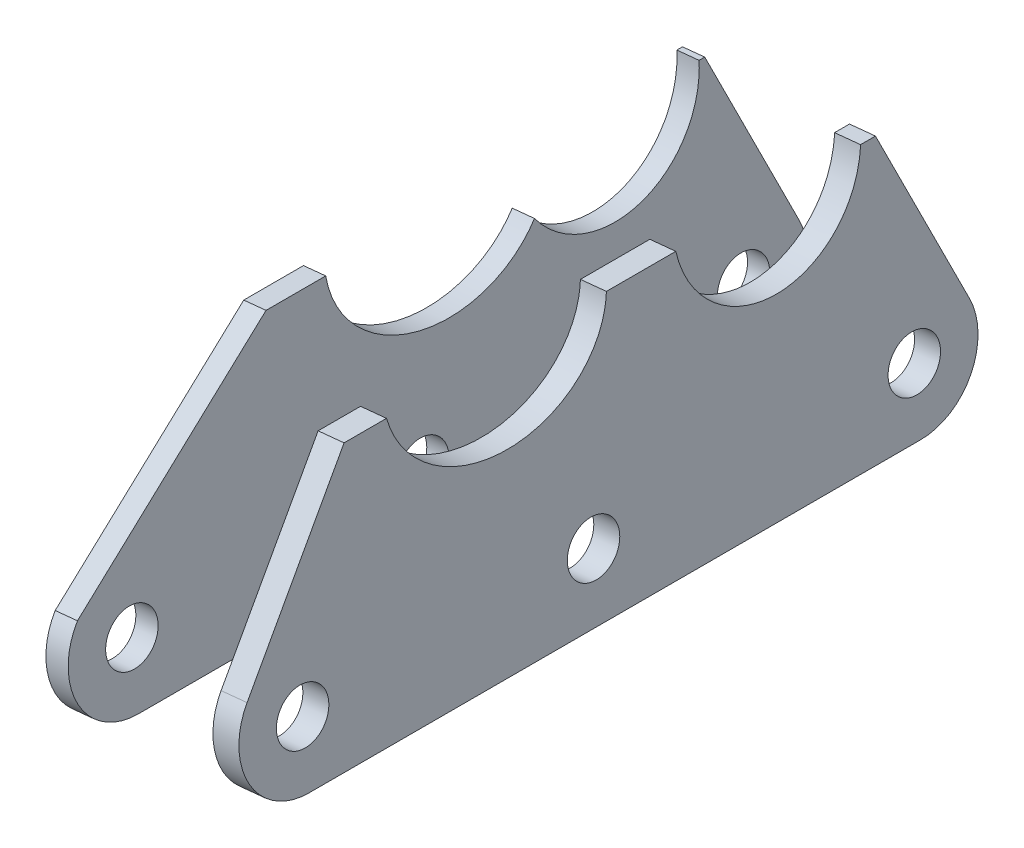
ISO-10303-21;
HEADER;
FILE_DESCRIPTION(('STEP AP214'),'2;1');
FILE_NAME('part.step','',(''),(''),'','','');
FILE_SCHEMA(('AUTOMOTIVE_DESIGN { 1 0 10303 214 1 1 1 1 }'));
ENDSEC;
DATA;
#1=APPLICATION_CONTEXT('core data for automotive mechanical design processes');
#2=APPLICATION_PROTOCOL_DEFINITION('international standard','automotive_design',2000,#1);
#3=PRODUCT_CONTEXT('',#1,'mechanical');
#4=PRODUCT('Part','Part','',(#3));
#5=PRODUCT_RELATED_PRODUCT_CATEGORY('part','',(#4));
#6=PRODUCT_DEFINITION_FORMATION('','',#4);
#7=PRODUCT_DEFINITION_CONTEXT('part definition',#1,'design');
#8=PRODUCT_DEFINITION('design','',#6,#7);
#9=PRODUCT_DEFINITION_SHAPE('','',#8);
#10=(LENGTH_UNIT() NAMED_UNIT(*) SI_UNIT(.MILLI.,.METRE.));
#11=(NAMED_UNIT(*) PLANE_ANGLE_UNIT() SI_UNIT($,.RADIAN.));
#12=(NAMED_UNIT(*) SI_UNIT($,.STERADIAN.) SOLID_ANGLE_UNIT());
#13=UNCERTAINTY_MEASURE_WITH_UNIT(LENGTH_MEASURE(1.E-05),#10,'distance_accuracy_value','');
#14=(GEOMETRIC_REPRESENTATION_CONTEXT(3) GLOBAL_UNCERTAINTY_ASSIGNED_CONTEXT((#13)) GLOBAL_UNIT_ASSIGNED_CONTEXT((#10,
#11,#12)) REPRESENTATION_CONTEXT('',''));
#15=CARTESIAN_POINT('',(0.,0.,0.));
#16=DIRECTION('',(0.,0.,1.));
#17=DIRECTION('',(1.,0.,0.));
#18=AXIS2_PLACEMENT_3D('',#15,#16,#17);
#19=CARTESIAN_POINT('',(1518.71231217313,-197.578604639231,120.328065139763));
#20=CARTESIAN_POINT('',(1517.4656444805,-185.040181282355,130.637058164234));
#21=CARTESIAN_POINT('',(1517.88172513405,-189.224933494766,147.70468465235));
#22=CARTESIAN_POINT('',(1519.37296780499,-204.22318206299,147.42815610901));
#23=CARTESIAN_POINT('',(1520.86421047592,-219.221430631214,147.15162756567));
#24=CARTESIAN_POINT('',(1521.32469219262,-223.852748781291,129.92145575873));
#25=CARTESIAN_POINT('',(1520.10412374051,-211.576819855684,120.069974600354));
#26=(BOUNDED_CURVE() B_SPLINE_CURVE(3,(#19,#20,#21,#22,#23,#24,#25),.UNSPECIFIED.,.F.,
.F.) B_SPLINE_CURVE_WITH_KNOTS((4,3,4),(0.,0.5,1.),
.UNSPECIFIED.) CURVE() GEOMETRIC_REPRESENTATION_ITEM() RATIONAL_B_SPLINE_CURVE((1.,
0.529268885905459,0.529268885905459,1.,0.529268885905459,0.529268885905459,1.)) REPRESENTATION_ITEM(''));
#27=DIRECTION('',(0.995093407225825,0.098939935797927,0.));
#28=VECTOR('',#27,1.);
#29=SURFACE_OF_LINEAR_EXTRUSION('',#26,#28);
#30=CARTESIAN_POINT('',(1521.69759239481,-197.281784831837,120.328065139763));
#31=CARTESIAN_POINT('',(1520.45092470218,-184.743361474961,130.637058164234));
#32=CARTESIAN_POINT('',(1520.86700535573,-188.928113687372,147.70468465235));
#33=CARTESIAN_POINT('',(1522.35824802667,-203.926362255596,147.42815610901));
#34=CARTESIAN_POINT('',(1523.8494906976,-218.924610823821,147.15162756567));
#35=CARTESIAN_POINT('',(1524.30997241429,-223.555928973897,129.92145575873));
#36=CARTESIAN_POINT('',(1523.08940396219,-211.280000048291,120.069974600354));
#37=(BOUNDED_CURVE() B_SPLINE_CURVE(3,(#30,#31,#32,#33,#34,#35,#36),.UNSPECIFIED.,.F.,
.F.) B_SPLINE_CURVE_WITH_KNOTS((4,3,4),(0.,0.5,1.),
.UNSPECIFIED.) CURVE() GEOMETRIC_REPRESENTATION_ITEM() RATIONAL_B_SPLINE_CURVE((1.,
0.529268885905459,0.529268885905459,1.,0.529268885905459,0.529268885905459,1.)) REPRESENTATION_ITEM(''));
#38=CARTESIAN_POINT('',(1522.4271576291,-204.619424066495,147.392323290686));
#39=VERTEX_POINT('',#38);
#40=CARTESIAN_POINT('',(1523.08940396219,-211.280000048291,120.069974600354));
#41=VERTEX_POINT('',#40);
#42=EDGE_CURVE('E157',#39,#41,#37,.T.);
#43=ORIENTED_EDGE('',*,*,#42,.T.);
#44=DIRECTION('',(0.995093407225825,0.098939935797927,0.));
#45=VECTOR('',#44,1.);
#46=CARTESIAN_POINT('',(1520.10412374051,-211.576819855684,120.069974600354));
#47=LINE('',#46,#45);
#48=CARTESIAN_POINT('',(1520.10412374051,-211.576819855684,120.069974600354));
#49=VERTEX_POINT('',#48);
#50=EDGE_CURVE('E12',#49,#41,#47,.T.);
#51=ORIENTED_EDGE('',*,*,#50,.F.);
#52=CARTESIAN_POINT('',(1519.44187740742,-204.916243873889,147.392323290686));
#53=VERTEX_POINT('',#52);
#54=EDGE_CURVE('E219',#53,#49,#26,.T.);
#55=ORIENTED_EDGE('',*,*,#54,.F.);
#56=DIRECTION('',(0.995093407225825,0.098939935797927,0.));
#57=VECTOR('',#56,1.);
#58=CARTESIAN_POINT('',(1519.44187740742,-204.916243873889,147.392323290686));
#59=LINE('',#58,#57);
#60=EDGE_CURVE('E144',#53,#39,#59,.T.);
#61=ORIENTED_EDGE('',*,*,#60,.T.);
#62=EDGE_LOOP('',(#43,#51,#55,#61));
#63=FACE_BOUND('',#62,.T.);
#64=ADVANCED_FACE('F46',(#63),#29,.F.);
#65=CARTESIAN_POINT('',(1518.45120238621,-194.952479754148,118.012718514984));
#66=CARTESIAN_POINT('',(1520.0623228753,-211.156405540121,136.982090668335));
#67=CARTESIAN_POINT('',(1521.94443662444,-230.085859741998,120.652410351239));
#68=CARTESIAN_POINT('',(1520.33331613535,-213.881933956025,101.683038197888));
#69=CARTESIAN_POINT('',(1518.72219564626,-197.678008170053,82.7136660445375));
#70=CARTESIAN_POINT('',(1516.84008189712,-178.748553968175,99.043346361633));
#71=CARTESIAN_POINT('',(1518.45120238621,-194.952479754148,118.012718514984));
#72=(BOUNDED_CURVE() B_SPLINE_CURVE(3,(#65,#66,#67,#68,#69,#70,#71),.UNSPECIFIED.,.T.,
.F.) B_SPLINE_CURVE_WITH_KNOTS((4,3,4),(0.,0.5,1.),
.UNSPECIFIED.) CURVE() GEOMETRIC_REPRESENTATION_ITEM() RATIONAL_B_SPLINE_CURVE((1.,
0.333333333333333,0.333333333333333,1.,0.333333333333333,0.333333333333333,1.)) REPRESENTATION_ITEM(''));
#73=DIRECTION('',(0.995093407225825,0.098939935797927,0.));
#74=VECTOR('',#73,1.);
#75=SURFACE_OF_LINEAR_EXTRUSION('',#72,#74);
#76=CARTESIAN_POINT('',(1521.43648260788,-194.655659946754,118.012718514984));
#77=CARTESIAN_POINT('',(1523.04760309697,-210.859585732727,136.982090668335));
#78=CARTESIAN_POINT('',(1524.92971684612,-229.789039934604,120.652410351239));
#79=CARTESIAN_POINT('',(1523.31859635703,-213.585114148632,101.683038197888));
#80=CARTESIAN_POINT('',(1521.70747586794,-197.381188362659,82.7136660445375));
#81=CARTESIAN_POINT('',(1519.8253621188,-178.451734160782,99.043346361633));
#82=CARTESIAN_POINT('',(1521.43648260788,-194.655659946754,118.012718514984));
#83=(BOUNDED_CURVE() B_SPLINE_CURVE(3,(#76,#77,#78,#79,#80,#81,#82),.UNSPECIFIED.,.T.,
.F.) B_SPLINE_CURVE_WITH_KNOTS((4,3,4),(0.,0.5,1.),
.UNSPECIFIED.) CURVE() GEOMETRIC_REPRESENTATION_ITEM() RATIONAL_B_SPLINE_CURVE((1.,
0.333333333333333,0.333333333333333,1.,0.333333333333333,0.333333333333333,1.)) REPRESENTATION_ITEM(''));
#84=CARTESIAN_POINT('',(1522.4271576291,-204.619424066495,97.3416302671522));
#85=VERTEX_POINT('',#84);
#86=EDGE_CURVE('E162',#41,#85,#83,.T.);
#87=ORIENTED_EDGE('',*,*,#86,.T.);
#88=DIRECTION('',(0.995093407225825,0.098939935797927,0.));
#89=VECTOR('',#88,1.);
#90=CARTESIAN_POINT('',(1519.44187740742,-204.916243873889,97.3416302671522));
#91=LINE('',#90,#89);
#92=CARTESIAN_POINT('',(1519.44187740742,-204.916243873889,97.3416302671522));
#93=VERTEX_POINT('',#92);
#94=EDGE_CURVE('E55',#93,#85,#91,.T.);
#95=ORIENTED_EDGE('',*,*,#94,.F.);
#96=EDGE_CURVE('E109',#49,#93,#72,.T.);
#97=ORIENTED_EDGE('',*,*,#96,.F.);
#98=ORIENTED_EDGE('',*,*,#50,.T.);
#99=EDGE_LOOP('',(#87,#95,#97,#98));
#100=FACE_BOUND('',#99,.T.);
#101=ADVANCED_FACE('F203',(#100),#75,.F.);
#102=CARTESIAN_POINT('',(1519.44187740742,-204.916243873903,5.33185246953929E-11));
#103=DIRECTION('',(-0.098939935797927,0.995093407225825,-1.45976380936334E-13));
#104=DIRECTION('',(-0.995093407225825,-0.098939935797927,0.));
#105=AXIS2_PLACEMENT_3D('',#102,#103,#104);
#106=PLANE('',#105);
#107=DIRECTION('',(0.,1.4515372155424E-13,1.));
#108=VECTOR('',#107,1.);
#109=CARTESIAN_POINT('',(1522.4271576291,-204.619424066509,5.331890435523E-11));
#110=LINE('',#109,#108);
#111=CARTESIAN_POINT('',(1522.4271576291,-204.619424066495,96.5848122084578));
#112=VERTEX_POINT('',#111);
#113=EDGE_CURVE('E170',#112,#85,#110,.T.);
#114=ORIENTED_EDGE('',*,*,#113,.F.);
#115=DIRECTION('',(0.995093407225825,0.098939935797927,0.));
#116=VECTOR('',#115,1.);
#117=CARTESIAN_POINT('',(1519.44187740742,-204.916243873889,96.5848122084578));
#118=LINE('',#117,#116);
#119=CARTESIAN_POINT('',(1519.44187740742,-204.916243873889,96.5848122084578));
#120=VERTEX_POINT('',#119);
#121=EDGE_CURVE('E196',#120,#112,#118,.T.);
#122=ORIENTED_EDGE('',*,*,#121,.F.);
#123=DIRECTION('',(0.,1.4515372155424E-13,1.));
#124=VECTOR('',#123,1.);
#125=CARTESIAN_POINT('',(1519.44187740742,-204.916243873903,5.33185246953929E-11));
#126=LINE('',#125,#124);
#127=EDGE_CURVE('E202',#120,#93,#126,.T.);
#128=ORIENTED_EDGE('',*,*,#127,.T.);
#129=ORIENTED_EDGE('',*,*,#94,.T.);
#130=EDGE_LOOP('',(#114,#122,#128,#129));
#131=FACE_BOUND('',#130,.T.);
#132=ADVANCED_FACE('F200',(#131),#106,.T.);
#133=CARTESIAN_POINT('',(1493.84865593958,52.4888751705801,212.772346572478));
#134=DIRECTION('',(-0.0405387972043441,0.407721002743493,-0.912206221116182));
#135=DIRECTION('',(0.,0.912956703397771,0.40805643938195));
#136=AXIS2_PLACEMENT_3D('',#133,#134,#135);
#137=PLANE('',#136);
#138=DIRECTION('',(-0.090253624951706,0.907730396663096,0.409731387810276));
#139=VECTOR('',#138,1.);
#140=CARTESIAN_POINT('',(1496.83393616126,52.7856949779739,212.772346572478));
#141=LINE('',#140,#139);
#142=CARTESIAN_POINT('',(1524.70448615151,-227.52377083466,86.2462471205124));
#143=VERTEX_POINT('',#142);
#144=EDGE_CURVE('E176',#143,#112,#141,.T.);
#145=ORIENTED_EDGE('',*,*,#144,.F.);
#146=DIRECTION('',(0.995093407225825,0.098939935797927,0.));
#147=VECTOR('',#146,1.);
#148=CARTESIAN_POINT('',(1521.71920592983,-227.820590642053,86.2462471205124));
#149=LINE('',#148,#147);
#150=CARTESIAN_POINT('',(1521.71920592983,-227.820590642053,86.2462471205124));
#151=VERTEX_POINT('',#150);
#152=EDGE_CURVE('E194',#151,#143,#149,.T.);
#153=ORIENTED_EDGE('',*,*,#152,.F.);
#154=DIRECTION('',(-0.090253624951706,0.907730396663096,0.409731387810276));
#155=VECTOR('',#154,1.);
#156=CARTESIAN_POINT('',(1493.84865593958,52.4888751705801,212.772346572478));
#157=LINE('',#156,#155);
#158=EDGE_CURVE('E215',#151,#120,#157,.T.);
#159=ORIENTED_EDGE('',*,*,#158,.T.);
#160=ORIENTED_EDGE('',*,*,#121,.T.);
#161=EDGE_LOOP('',(#145,#153,#159,#160));
#162=FACE_BOUND('',#161,.T.);
#163=ADVANCED_FACE('F211',(#162),#137,.T.);
#164=CARTESIAN_POINT('',(1522.06378570607,-231.286219165373,93.9999999999999));
#165=DIRECTION('',(0.995093407225825,0.098939935797927,0.));
#166=DIRECTION('',(-0.098939935797927,0.995093407225825,0.));
#167=AXIS2_PLACEMENT_3D('',#164,#165,#166);
#168=CYLINDRICAL_SURFACE('',#167,8.5000000000001);
#169=CARTESIAN_POINT('',(1525.04906592774,-230.989399357979,93.9999999999999));
#170=DIRECTION('',(-0.995093407225825,-0.098939935797928,0.));
#171=DIRECTION('',(0.098939935797928,-0.995093407225825,0.));
#172=AXIS2_PLACEMENT_3D('',#169,#170,#171);
#173=CIRCLE('',#172,8.5000000000001);
#174=CARTESIAN_POINT('',(1525.89005538203,-239.447693319399,93.9999999999999));
#175=VERTEX_POINT('',#174);
#176=EDGE_CURVE('E179',#143,#175,#173,.T.);
#177=ORIENTED_EDGE('',*,*,#176,.T.);
#178=DIRECTION('',(0.995093407225825,0.098939935797927,0.));
#179=VECTOR('',#178,1.);
#180=CARTESIAN_POINT('',(1522.90477516035,-239.744513126793,93.9999999999999));
#181=LINE('',#180,#179);
#182=CARTESIAN_POINT('',(1522.90477516035,-239.744513126793,93.9999999999999));
#183=VERTEX_POINT('',#182);
#184=EDGE_CURVE('E192',#183,#175,#181,.T.);
#185=ORIENTED_EDGE('',*,*,#184,.F.);
#186=CARTESIAN_POINT('',(1522.06378570607,-231.286219165373,93.9999999999999));
#187=DIRECTION('',(-0.995093407225825,-0.098939935797928,0.));
#188=DIRECTION('',(0.098939935797928,-0.995093407225825,0.));
#189=AXIS2_PLACEMENT_3D('',#186,#187,#188);
#190=CIRCLE('',#189,8.5000000000001);
#191=EDGE_CURVE('E217',#151,#183,#190,.T.);
#192=ORIENTED_EDGE('',*,*,#191,.F.);
#193=ORIENTED_EDGE('',*,*,#152,.T.);
#194=EDGE_LOOP('',(#177,#185,#192,#193));
#195=FACE_BOUND('',#194,.T.);
#196=ADVANCED_FACE('F340',(#195),#168,.T.);
#197=CARTESIAN_POINT('',(1522.90477516035,-239.744513126793,1.60722598739745E-12));
#198=DIRECTION('',(0.098939935797927,-0.995093407225825,0.));
#199=DIRECTION('',(0.995093407225825,0.098939935797927,0.));
#200=AXIS2_PLACEMENT_3D('',#197,#198,#199);
#201=PLANE('',#200);
#202=DIRECTION('',(0.,0.,-1.));
#203=VECTOR('',#202,1.);
#204=CARTESIAN_POINT('',(1525.89005538203,-239.447693319399,1.6076056472345E-12));
#205=LINE('',#204,#203);
#206=CARTESIAN_POINT('',(1525.89005538203,-239.447693319399,176.));
#207=VERTEX_POINT('',#206);
#208=EDGE_CURVE('E182',#207,#175,#205,.T.);
#209=ORIENTED_EDGE('',*,*,#208,.F.);
#210=DIRECTION('',(0.995093407225825,0.098939935797927,0.));
#211=VECTOR('',#210,1.);
#212=CARTESIAN_POINT('',(1522.90477516035,-239.744513126793,176.));
#213=LINE('',#212,#211);
#214=CARTESIAN_POINT('',(1522.90477516035,-239.744513126793,176.));
#215=VERTEX_POINT('',#214);
#216=EDGE_CURVE('E139',#215,#207,#213,.T.);
#217=ORIENTED_EDGE('',*,*,#216,.F.);
#218=DIRECTION('',(0.,0.,-1.));
#219=VECTOR('',#218,1.);
#220=CARTESIAN_POINT('',(1522.90477516035,-239.744513126793,1.60722598739745E-12));
#221=LINE('',#220,#219);
#222=EDGE_CURVE('E132',#215,#183,#221,.T.);
#223=ORIENTED_EDGE('',*,*,#222,.T.);
#224=ORIENTED_EDGE('',*,*,#184,.T.);
#225=EDGE_LOOP('',(#209,#217,#223,#224));
#226=FACE_BOUND('',#225,.T.);
#227=ADVANCED_FACE('F228',(#226),#201,.T.);
#228=CARTESIAN_POINT('',(1522.06378570607,-231.286219165373,176.));
#229=DIRECTION('',(0.995093407225825,0.098939935797927,0.));
#230=DIRECTION('',(-0.098939935797927,0.995093407225825,0.));
#231=AXIS2_PLACEMENT_3D('',#228,#229,#230);
#232=CYLINDRICAL_SURFACE('',#231,8.5);
#233=CARTESIAN_POINT('',(1525.04906592774,-230.989399357979,176.));
#234=DIRECTION('',(-0.995093407225825,-0.098939935797928,0.));
#235=DIRECTION('',(0.098939935797928,-0.995093407225825,0.));
#236=AXIS2_PLACEMENT_3D('',#233,#234,#235);
#237=CIRCLE('',#236,8.5);
#238=CARTESIAN_POINT('',(1524.54344496667,-225.904090975074,182.792200386802));
#239=VERTEX_POINT('',#238);
#240=EDGE_CURVE('E138',#207,#239,#237,.T.);
#241=ORIENTED_EDGE('',*,*,#240,.T.);
#242=DIRECTION('',(0.995093407225825,0.098939935797927,0.));
#243=VECTOR('',#242,1.);
#244=CARTESIAN_POINT('',(1521.55816474499,-226.200910782467,182.792200386802));
#245=LINE('',#244,#243);
#246=CARTESIAN_POINT('',(1521.55816474499,-226.200910782467,182.792200386802));
#247=VERTEX_POINT('',#246);
#248=EDGE_CURVE('E135',#247,#239,#245,.T.);
#249=ORIENTED_EDGE('',*,*,#248,.F.);
#250=CARTESIAN_POINT('',(1522.06378570607,-231.286219165373,176.));
#251=DIRECTION('',(-0.995093407225825,-0.098939935797928,0.));
#252=DIRECTION('',(0.098939935797928,-0.995093407225825,0.));
#253=AXIS2_PLACEMENT_3D('',#250,#251,#252);
#254=CIRCLE('',#253,8.5);
#255=EDGE_CURVE('E126',#215,#247,#254,.T.);
#256=ORIENTED_EDGE('',*,*,#255,.F.);
#257=ORIENTED_EDGE('',*,*,#216,.T.);
#258=EDGE_LOOP('',(#241,#249,#256,#257));
#259=FACE_BOUND('',#258,.T.);
#260=ADVANCED_FACE('F136',(#259),#232,.T.);
#261=CARTESIAN_POINT('',(1498.71006538922,3.59500381164267,-112.980528659317));
#262=DIRECTION('',(0.0779854276457419,-0.784342381911978,-0.615406614370983));
#263=DIRECTION('',(0.,0.61728656121088,-0.786738394479669));
#264=AXIS2_PLACEMENT_3D('',#261,#262,#263);
#265=PLANE('',#264);
#266=DIRECTION('',(-0.0608882909154844,0.612387064723731,-0.788209806452853));
#267=VECTOR('',#266,1.);
#268=CARTESIAN_POINT('',(1501.6953456109,3.89182361903645,-112.980528659317));
#269=LINE('',#268,#267);
#270=CARTESIAN_POINT('',(1522.4271576291,-204.619424066495,155.396482627817));
#271=VERTEX_POINT('',#270);
#272=EDGE_CURVE('E95',#239,#271,#269,.T.);
#273=ORIENTED_EDGE('',*,*,#272,.T.);
#274=DIRECTION('',(0.995093407225825,0.098939935797927,0.));
#275=VECTOR('',#274,1.);
#276=CARTESIAN_POINT('',(1519.44187740742,-204.916243873889,155.396482627817));
#277=LINE('',#276,#275);
#278=CARTESIAN_POINT('',(1519.44187740742,-204.916243873889,155.396482627817));
#279=VERTEX_POINT('',#278);
#280=EDGE_CURVE('E140',#279,#271,#277,.T.);
#281=ORIENTED_EDGE('',*,*,#280,.F.);
#282=DIRECTION('',(-0.0608882909154844,0.612387064723731,-0.788209806452853));
#283=VECTOR('',#282,1.);
#284=CARTESIAN_POINT('',(1498.71006538922,3.59500381164267,-112.980528659317));
#285=LINE('',#284,#283);
#286=EDGE_CURVE('E130',#247,#279,#285,.T.);
#287=ORIENTED_EDGE('',*,*,#286,.F.);
#288=ORIENTED_EDGE('',*,*,#248,.T.);
#289=EDGE_LOOP('',(#273,#281,#287,#288));
#290=FACE_BOUND('',#289,.T.);
#291=ADVANCED_FACE('F142',(#290),#265,.F.);
#292=CARTESIAN_POINT('',(1522.06378570607,-231.286219165373,93.9999999999999));
#293=DIRECTION('',(0.995093407225825,0.098939935797927,0.));
#294=DIRECTION('',(-0.098939935797927,0.995093407225825,0.));
#295=AXIS2_PLACEMENT_3D('',#292,#293,#294);
#296=CYLINDRICAL_SURFACE('',#295,3.50000000000006);
#297=CARTESIAN_POINT('',(1522.06378570607,-231.286219165373,93.9999999999999));
#298=DIRECTION('',(-0.995093407225825,-0.098939935797928,0.));
#299=DIRECTION('',(0.098939935797928,-0.995093407225825,0.));
#300=AXIS2_PLACEMENT_3D('',#297,#298,#299);
#301=CIRCLE('',#300,3.50000000000006);
#302=CARTESIAN_POINT('',(1522.41007548136,-234.769046090664,93.9999999999999));
#303=VERTEX_POINT('',#302);
#304=EDGE_CURVE('E258',#303,#303,#301,.T.);
#305=ORIENTED_EDGE('',*,*,#304,.T.);
#306=EDGE_LOOP('',(#305));
#307=FACE_BOUND('',#306,.T.);
#308=CARTESIAN_POINT('',(1525.04906592774,-230.989399357979,93.9999999999999));
#309=DIRECTION('',(-0.995093407225825,-0.098939935797928,0.));
#310=DIRECTION('',(0.098939935797928,-0.995093407225825,0.));
#311=AXIS2_PLACEMENT_3D('',#308,#309,#310);
#312=CIRCLE('',#311,3.50000000000006);
#313=CARTESIAN_POINT('',(1525.39535570304,-234.47222628327,93.9999999999999));
#314=VERTEX_POINT('',#313);
#315=EDGE_CURVE('E154',#314,#314,#312,.T.);
#316=ORIENTED_EDGE('',*,*,#315,.F.);
#317=EDGE_LOOP('',(#316));
#318=FACE_BOUND('',#317,.T.);
#319=ADVANCED_FACE('F253',(#307,#318),#296,.F.);
#320=CARTESIAN_POINT('',(1522.06378570607,-231.286219165373,137.));
#321=DIRECTION('',(0.995093407225825,0.098939935797927,0.));
#322=DIRECTION('',(-0.098939935797927,0.995093407225825,0.));
#323=AXIS2_PLACEMENT_3D('',#320,#321,#322);
#324=CYLINDRICAL_SURFACE('',#323,3.50000000000004);
#325=CARTESIAN_POINT('',(1522.06378570607,-231.286219165373,137.));
#326=DIRECTION('',(-0.995093407225825,-0.098939935797928,0.));
#327=DIRECTION('',(0.098939935797928,-0.995093407225825,0.));
#328=AXIS2_PLACEMENT_3D('',#325,#326,#327);
#329=CIRCLE('',#328,3.50000000000004);
#330=CARTESIAN_POINT('',(1522.41007548136,-234.769046090664,137.));
#331=VERTEX_POINT('',#330);
#332=EDGE_CURVE('E264',#331,#331,#329,.T.);
#333=ORIENTED_EDGE('',*,*,#332,.T.);
#334=EDGE_LOOP('',(#333));
#335=FACE_BOUND('',#334,.T.);
#336=CARTESIAN_POINT('',(1525.04906592774,-230.989399357979,137.));
#337=DIRECTION('',(-0.995093407225825,-0.098939935797928,0.));
#338=DIRECTION('',(0.098939935797928,-0.995093407225825,0.));
#339=AXIS2_PLACEMENT_3D('',#336,#337,#338);
#340=CIRCLE('',#339,3.50000000000004);
#341=CARTESIAN_POINT('',(1525.39535570304,-234.47222628327,137.));
#342=VERTEX_POINT('',#341);
#343=EDGE_CURVE('E151',#342,#342,#340,.T.);
#344=ORIENTED_EDGE('',*,*,#343,.F.);
#345=EDGE_LOOP('',(#344));
#346=FACE_BOUND('',#345,.T.);
#347=ADVANCED_FACE('F241',(#335,#346),#324,.F.);
#348=CARTESIAN_POINT('',(1522.06378570607,-231.286219165373,176.));
#349=DIRECTION('',(0.995093407225825,0.098939935797927,0.));
#350=DIRECTION('',(-0.098939935797927,0.995093407225825,0.));
#351=AXIS2_PLACEMENT_3D('',#348,#349,#350);
#352=CYLINDRICAL_SURFACE('',#351,3.50000000000004);
#353=CARTESIAN_POINT('',(1522.06378570607,-231.286219165373,176.));
#354=DIRECTION('',(-0.995093407225825,-0.098939935797928,0.));
#355=DIRECTION('',(0.098939935797928,-0.995093407225825,0.));
#356=AXIS2_PLACEMENT_3D('',#353,#354,#355);
#357=CIRCLE('',#356,3.50000000000004);
#358=CARTESIAN_POINT('',(1522.41007548136,-234.769046090664,176.));
#359=VERTEX_POINT('',#358);
#360=EDGE_CURVE('E188',#359,#359,#357,.T.);
#361=ORIENTED_EDGE('',*,*,#360,.T.);
#362=EDGE_LOOP('',(#361));
#363=FACE_BOUND('',#362,.T.);
#364=CARTESIAN_POINT('',(1525.04906592774,-230.989399357979,176.));
#365=DIRECTION('',(-0.995093407225825,-0.098939935797928,0.));
#366=DIRECTION('',(0.098939935797928,-0.995093407225825,0.));
#367=AXIS2_PLACEMENT_3D('',#364,#365,#366);
#368=CIRCLE('',#367,3.50000000000004);
#369=CARTESIAN_POINT('',(1525.39535570304,-234.47222628327,176.));
#370=VERTEX_POINT('',#369);
#371=EDGE_CURVE('E148',#370,#370,#368,.T.);
#372=ORIENTED_EDGE('',*,*,#371,.F.);
#373=EDGE_LOOP('',(#372));
#374=FACE_BOUND('',#373,.T.);
#375=ADVANCED_FACE('F48',(#363,#374),#352,.F.);
#376=CARTESIAN_POINT('',(1519.44187740742,-204.91624387389,4.05195772325884E-12));
#377=DIRECTION('',(0.098939935797927,-0.995093407225825,0.));
#378=DIRECTION('',(0.995093407225825,0.098939935797927,0.));
#379=AXIS2_PLACEMENT_3D('',#376,#377,#378);
#380=PLANE('',#379);
#381=DIRECTION('',(0.,0.,-1.));
#382=VECTOR('',#381,1.);
#383=CARTESIAN_POINT('',(1522.4271576291,-204.619424066496,4.05233738309589E-12));
#384=LINE('',#383,#382);
#385=EDGE_CURVE('E101',#271,#39,#384,.T.);
#386=ORIENTED_EDGE('',*,*,#385,.T.);
#387=ORIENTED_EDGE('',*,*,#60,.F.);
#388=DIRECTION('',(0.,0.,-1.));
#389=VECTOR('',#388,1.);
#390=CARTESIAN_POINT('',(1519.44187740742,-204.91624387389,4.05195772325884E-12));
#391=LINE('',#390,#389);
#392=EDGE_CURVE('E63',#279,#53,#391,.T.);
#393=ORIENTED_EDGE('',*,*,#392,.F.);
#394=ORIENTED_EDGE('',*,*,#280,.T.);
#395=EDGE_LOOP('',(#386,#387,#393,#394));
#396=FACE_BOUND('',#395,.T.);
#397=ADVANCED_FACE('F232',(#396),#380,.F.);
#398=CARTESIAN_POINT('',(1484.39297058168,147.589908788249,1.60722598739745E-12));
#399=DIRECTION('',(-0.995093407225825,-0.098939935797928,0.));
#400=DIRECTION('',(0.098939935797928,-0.995093407225825,0.));
#401=AXIS2_PLACEMENT_3D('',#398,#399,#400);
#402=PLANE('',#401);
#403=ORIENTED_EDGE('',*,*,#360,.F.);
#404=EDGE_LOOP('',(#403));
#405=FACE_BOUND('',#404,.T.);
#406=ORIENTED_EDGE('',*,*,#332,.F.);
#407=EDGE_LOOP('',(#406));
#408=FACE_BOUND('',#407,.T.);
#409=ORIENTED_EDGE('',*,*,#304,.F.);
#410=EDGE_LOOP('',(#409));
#411=FACE_BOUND('',#410,.T.);
#412=ORIENTED_EDGE('',*,*,#54,.T.);
#413=ORIENTED_EDGE('',*,*,#96,.T.);
#414=ORIENTED_EDGE('',*,*,#127,.F.);
#415=ORIENTED_EDGE('',*,*,#158,.F.);
#416=ORIENTED_EDGE('',*,*,#191,.T.);
#417=ORIENTED_EDGE('',*,*,#222,.F.);
#418=ORIENTED_EDGE('',*,*,#255,.T.);
#419=ORIENTED_EDGE('',*,*,#286,.T.);
#420=ORIENTED_EDGE('',*,*,#392,.T.);
#421=EDGE_LOOP('',(#412,#413,#414,#415,#416,#417,#418,#419,#420));
#422=FACE_BOUND('',#421,.T.);
#423=ADVANCED_FACE('F128',(#405,#408,#411,#422),#402,.T.);
#424=CARTESIAN_POINT('',(1487.37825080336,147.886728595642,1.6076056472345E-12));
#425=DIRECTION('',(-0.995093407225825,-0.098939935797928,0.));
#426=DIRECTION('',(0.098939935797928,-0.995093407225825,0.));
#427=AXIS2_PLACEMENT_3D('',#424,#425,#426);
#428=PLANE('',#427);
#429=ORIENTED_EDGE('',*,*,#371,.T.);
#430=EDGE_LOOP('',(#429));
#431=FACE_BOUND('',#430,.T.);
#432=ORIENTED_EDGE('',*,*,#343,.T.);
#433=EDGE_LOOP('',(#432));
#434=FACE_BOUND('',#433,.T.);
#435=ORIENTED_EDGE('',*,*,#315,.T.);
#436=EDGE_LOOP('',(#435));
#437=FACE_BOUND('',#436,.T.);
#438=ORIENTED_EDGE('',*,*,#42,.F.);
#439=ORIENTED_EDGE('',*,*,#385,.F.);
#440=ORIENTED_EDGE('',*,*,#272,.F.);
#441=ORIENTED_EDGE('',*,*,#240,.F.);
#442=ORIENTED_EDGE('',*,*,#208,.T.);
#443=ORIENTED_EDGE('',*,*,#176,.F.);
#444=ORIENTED_EDGE('',*,*,#144,.T.);
#445=ORIENTED_EDGE('',*,*,#113,.T.);
#446=ORIENTED_EDGE('',*,*,#86,.F.);
#447=EDGE_LOOP('',(#438,#439,#440,#441,#442,#443,#444,#445,#446));
#448=FACE_BOUND('',#447,.T.);
#449=ADVANCED_FACE('F207',(#431,#434,#437,#448),#428,.F.);
#450=CLOSED_SHELL('',(#64,#101,#132,#163,#196,#227,#260,#291,#319,#347,#375,#397,#423,#449));
#451=MANIFOLD_SOLID_BREP('B2',#450);
#452=CARTESIAN_POINT('',(1541.83147907001,-202.690095318541,2.31717015702413E-10));
#453=DIRECTION('',(-0.098939935797927,0.995093407225825,-6.54414992198536E-13));
#454=DIRECTION('',(-0.995093407225825,-0.098939935797927,0.));
#455=AXIS2_PLACEMENT_3D('',#452,#453,#454);
#456=PLANE('',#455);
#457=DIRECTION('',(0.,6.51210909663677E-13,1.));
#458=VECTOR('',#457,1.);
#459=CARTESIAN_POINT('',(1545.3143059953,-202.343805543248,2.31717458638889E-10));
#460=LINE('',#459,#458);
#461=CARTESIAN_POINT('',(1545.31430599529,-202.343805543142,162.13208349357));
#462=VERTEX_POINT('',#461);
#463=CARTESIAN_POINT('',(1545.31430599529,-202.343805543139,167.821084241912));
#464=VERTEX_POINT('',#463);
#465=EDGE_CURVE('E501',#462,#464,#460,.T.);
#466=ORIENTED_EDGE('',*,*,#465,.F.);
#467=DIRECTION('',(0.995093407225825,0.098939935797927,0.));
#468=VECTOR('',#467,1.);
#469=CARTESIAN_POINT('',(1541.83147907,-202.690095318435,162.13208349357));
#470=LINE('',#469,#468);
#471=CARTESIAN_POINT('',(1541.83147907,-202.690095318435,162.13208349357));
#472=VERTEX_POINT('',#471);
#473=EDGE_CURVE('E44',#472,#462,#470,.T.);
#474=ORIENTED_EDGE('',*,*,#473,.F.);
#475=DIRECTION('',(0.,6.51210909663677E-13,1.));
#476=VECTOR('',#475,1.);
#477=CARTESIAN_POINT('',(1541.83147907001,-202.690095318541,2.31717015702413E-10));
#478=LINE('',#477,#476);
#479=CARTESIAN_POINT('',(1541.83147907,-202.690095318432,167.821084241912));
#480=VERTEX_POINT('',#479);
#481=EDGE_CURVE('E641',#472,#480,#478,.T.);
#482=ORIENTED_EDGE('',*,*,#481,.T.);
#483=DIRECTION('',(0.995093407225825,0.098939935797927,0.));
#484=VECTOR('',#483,1.);
#485=CARTESIAN_POINT('',(1541.83147907,-202.690095318432,167.821084241912));
#486=LINE('',#485,#484);
#487=EDGE_CURVE('E401',#480,#464,#486,.T.);
#488=ORIENTED_EDGE('',*,*,#487,.T.);
#489=EDGE_LOOP('',(#466,#474,#482,#488));
#490=FACE_BOUND('',#489,.T.);
#491=ADVANCED_FACE('F384',(#490),#456,.T.);
#492=CARTESIAN_POINT('',(1541.83147907,-202.690095318438,162.132083493569));
#493=CARTESIAN_POINT('',(1543.84766876744,-222.968025149865,157.834079289536));
#494=CARTESIAN_POINT('',(1543.58402479144,-220.31641253,135.082547525811));
#495=CARTESIAN_POINT('',(1541.83147907,-202.690095318435,132.653019729061));
#496=(BOUNDED_CURVE() B_SPLINE_CURVE(3,(#492,#493,#494,#495),.UNSPECIFIED.,.F.,
.F.) B_SPLINE_CURVE_WITH_KNOTS((4,4),(0.555739934398423,0.989987357535435),
.UNSPECIFIED.) CURVE() GEOMETRIC_REPRESENTATION_ITEM() RATIONAL_B_SPLINE_CURVE((0.801895784700232,
0.35199214253537,0.404944032373534,0.960751454214726)) REPRESENTATION_ITEM(''));
#497=DIRECTION('',(0.995093407225825,0.098939935797927,0.));
#498=VECTOR('',#497,1.);
#499=SURFACE_OF_LINEAR_EXTRUSION('',#496,#498);
#500=CARTESIAN_POINT('',(1545.31430599529,-202.343805543145,162.132083493569));
#501=CARTESIAN_POINT('',(1547.33049569273,-222.621735374573,157.834079289536));
#502=CARTESIAN_POINT('',(1547.06685171673,-219.970122754708,135.082547525811));
#503=CARTESIAN_POINT('',(1545.31430599529,-202.343805543143,132.653019729061));
#504=(BOUNDED_CURVE() B_SPLINE_CURVE(3,(#500,#501,#502,#503),.UNSPECIFIED.,.F.,
.F.) B_SPLINE_CURVE_WITH_KNOTS((4,4),(0.555739934398423,0.989987357535435),
.UNSPECIFIED.) CURVE() GEOMETRIC_REPRESENTATION_ITEM() RATIONAL_B_SPLINE_CURVE((0.801895784700232,
0.35199214253537,0.404944032373534,0.960751454214726)) REPRESENTATION_ITEM(''));
#505=CARTESIAN_POINT('',(1545.31430599529,-202.343805543143,132.65301972906));
#506=VERTEX_POINT('',#505);
#507=EDGE_CURVE('E503',#462,#506,#504,.T.);
#508=ORIENTED_EDGE('',*,*,#507,.T.);
#509=DIRECTION('',(0.995093407225825,0.098939935797927,0.));
#510=VECTOR('',#509,1.);
#511=CARTESIAN_POINT('',(1541.83147907,-202.690095318435,132.65301972906));
#512=LINE('',#511,#510);
#513=CARTESIAN_POINT('',(1541.83147907,-202.690095318435,132.65301972906));
#514=VERTEX_POINT('',#513);
#515=EDGE_CURVE('E393',#514,#506,#512,.T.);
#516=ORIENTED_EDGE('',*,*,#515,.F.);
#517=EDGE_CURVE('E640',#472,#514,#496,.T.);
#518=ORIENTED_EDGE('',*,*,#517,.F.);
#519=ORIENTED_EDGE('',*,*,#473,.T.);
#520=EDGE_LOOP('',(#508,#516,#518,#519));
#521=FACE_BOUND('',#520,.T.);
#522=ADVANCED_FACE('F560',(#521),#499,.F.);
#523=CARTESIAN_POINT('',(1541.83147907002,-202.69009531859,4.14287893720276E-10));
#524=DIRECTION('',(0.098939935797927,-0.995093407225825,1.16979628609902E-12));
#525=DIRECTION('',(0.995093407225825,0.098939935797927,0.));
#526=AXIS2_PLACEMENT_3D('',#523,#524,#525);
#527=PLANE('',#526);
#528=DIRECTION('',(1.1567052096752E-13,-1.16406343743157E-12,-1.));
#529=VECTOR('',#528,1.);
#530=CARTESIAN_POINT('',(1545.31430599531,-202.343805543297,4.14288336656753E-10));
#531=LINE('',#530,#529);
#532=CARTESIAN_POINT('',(1545.31430599529,-202.343805543153,123.351051732971));
#533=VERTEX_POINT('',#532);
#534=EDGE_CURVE('E508',#506,#533,#531,.T.);
#535=ORIENTED_EDGE('',*,*,#534,.T.);
#536=DIRECTION('',(0.995093407225825,0.098939935797927,0.));
#537=VECTOR('',#536,1.);
#538=CARTESIAN_POINT('',(1541.83147907,-202.690095318446,123.351051732971));
#539=LINE('',#538,#537);
#540=CARTESIAN_POINT('',(1541.83147907,-202.690095318446,123.351051732971));
#541=VERTEX_POINT('',#540);
#542=EDGE_CURVE('E548',#541,#533,#539,.T.);
#543=ORIENTED_EDGE('',*,*,#542,.F.);
#544=DIRECTION('',(1.1567052096752E-13,-1.16406343743157E-12,-1.));
#545=VECTOR('',#544,1.);
#546=CARTESIAN_POINT('',(1541.83147907002,-202.69009531859,4.14287893720276E-10));
#547=LINE('',#546,#545);
#548=EDGE_CURVE('E556',#514,#541,#547,.T.);
#549=ORIENTED_EDGE('',*,*,#548,.F.);
#550=ORIENTED_EDGE('',*,*,#515,.T.);
#551=EDGE_LOOP('',(#535,#543,#549,#550));
#552=FACE_BOUND('',#551,.T.);
#553=ADVANCED_FACE('F553',(#552),#527,.F.);
#554=CARTESIAN_POINT('',(1541.83147907,-202.690095318446,123.351051732971));
#555=CARTESIAN_POINT('',(1543.09270371946,-215.374926004747,121.451794075539));
#556=CARTESIAN_POINT('',(1543.20014774036,-216.455549677853,109.95383571503));
#557=CARTESIAN_POINT('',(1542.59324320145,-210.351576589363,102.80812678875));
#558=CARTESIAN_POINT('',(1542.41422206205,-208.551062427569,100.700327502726));
#559=CARTESIAN_POINT('',(1542.15638248826,-205.957827876399,99.0558308166968));
#560=CARTESIAN_POINT('',(1541.83147907,-202.690095318432,98.5848122084579));
#561=(BOUNDED_CURVE() B_SPLINE_CURVE(3,(#554,#555,#556,#557,#558,#559,#560),.UNSPECIFIED.,.F.,
.F.) B_SPLINE_CURVE_WITH_KNOTS((4,3,4),(0.177741767783775,0.5,0.636368467594061),
.UNSPECIFIED.) CURVE() GEOMETRIC_REPRESENTATION_ITEM() RATIONAL_B_SPLINE_CURVE((0.541770016984111,
0.417579029373071,0.570322357045034,1.,0.818175376541251,0.685941043626376,0.603297001255375)) REPRESENTATION_ITEM(''));
#562=DIRECTION('',(0.995093407225825,0.098939935797927,0.));
#563=VECTOR('',#562,1.);
#564=SURFACE_OF_LINEAR_EXTRUSION('',#561,#563);
#565=CARTESIAN_POINT('',(1545.31430599529,-202.343805543153,123.351051732971));
#566=CARTESIAN_POINT('',(1546.57553064475,-215.028636229454,121.451794075539));
#567=CARTESIAN_POINT('',(1546.68297466565,-216.109259902561,109.95383571503));
#568=CARTESIAN_POINT('',(1546.07607012674,-210.005286814071,102.80812678875));
#569=CARTESIAN_POINT('',(1545.89704898734,-208.204772652276,100.700327502726));
#570=CARTESIAN_POINT('',(1545.63920941355,-205.611538101106,99.0558308166968));
#571=CARTESIAN_POINT('',(1545.31430599529,-202.343805543139,98.5848122084579));
#572=(BOUNDED_CURVE() B_SPLINE_CURVE(3,(#565,#566,#567,#568,#569,#570,#571),.UNSPECIFIED.,.F.,
.F.) B_SPLINE_CURVE_WITH_KNOTS((4,3,4),(0.177741767783775,0.5,0.636368467594061),
.UNSPECIFIED.) CURVE() GEOMETRIC_REPRESENTATION_ITEM() RATIONAL_B_SPLINE_CURVE((0.541770016984111,
0.417579029373071,0.570322357045034,1.,0.818175376541251,0.685941043626376,0.603297001255375)) REPRESENTATION_ITEM(''));
#573=CARTESIAN_POINT('',(1545.31430599529,-202.343805543142,98.5848122084584));
#574=VERTEX_POINT('',#573);
#575=EDGE_CURVE('E514',#533,#574,#572,.T.);
#576=ORIENTED_EDGE('',*,*,#575,.T.);
#577=DIRECTION('',(0.995093407225825,0.098939935797927,0.));
#578=VECTOR('',#577,1.);
#579=CARTESIAN_POINT('',(1541.83147907,-202.690095318435,98.5848122084584));
#580=LINE('',#579,#578);
#581=CARTESIAN_POINT('',(1541.83147907,-202.690095318435,98.5848122084584));
#582=VERTEX_POINT('',#581);
#583=EDGE_CURVE('E546',#582,#574,#580,.T.);
#584=ORIENTED_EDGE('',*,*,#583,.F.);
#585=EDGE_CURVE('E623',#541,#582,#561,.T.);
#586=ORIENTED_EDGE('',*,*,#585,.F.);
#587=ORIENTED_EDGE('',*,*,#542,.T.);
#588=EDGE_LOOP('',(#576,#584,#586,#587));
#589=FACE_BOUND('',#588,.T.);
#590=ADVANCED_FACE('F618',(#589),#564,.F.);
#591=CARTESIAN_POINT('',(1541.83147907,-202.690095318443,2.92462781501132E-11));
#592=DIRECTION('',(-0.098939935797927,0.995093407225825,0.));
#593=DIRECTION('',(-0.995093407225825,-0.098939935797927,0.));
#594=AXIS2_PLACEMENT_3D('',#591,#592,#593);
#595=PLANE('',#594);
#596=DIRECTION('',(0.,0.,1.));
#597=VECTOR('',#596,1.);
#598=CARTESIAN_POINT('',(1545.31430599529,-202.343805543151,2.92467210865898E-11));
#599=LINE('',#598,#597);
#600=CARTESIAN_POINT('',(1545.31430599529,-202.343805543143,96.5848122084579));
#601=VERTEX_POINT('',#600);
#602=EDGE_CURVE('E519',#601,#574,#599,.T.);
#603=ORIENTED_EDGE('',*,*,#602,.F.);
#604=DIRECTION('',(0.995093407225825,0.098939935797927,0.));
#605=VECTOR('',#604,1.);
#606=CARTESIAN_POINT('',(1541.83147907,-202.690095318435,96.5848122084579));
#607=LINE('',#606,#605);
#608=CARTESIAN_POINT('',(1541.83147907,-202.690095318435,96.5848122084579));
#609=VERTEX_POINT('',#608);
#610=EDGE_CURVE('E544',#609,#601,#607,.T.);
#611=ORIENTED_EDGE('',*,*,#610,.F.);
#612=DIRECTION('',(0.,0.,1.));
#613=VECTOR('',#612,1.);
#614=CARTESIAN_POINT('',(1541.83147907,-202.690095318443,2.92462781501132E-11));
#615=LINE('',#614,#613);
#616=EDGE_CURVE('E629',#609,#582,#615,.T.);
#617=ORIENTED_EDGE('',*,*,#616,.T.);
#618=ORIENTED_EDGE('',*,*,#583,.T.);
#619=EDGE_LOOP('',(#603,#611,#617,#618));
#620=FACE_BOUND('',#619,.T.);
#621=ADVANCED_FACE('F614',(#620),#595,.T.);
#622=CARTESIAN_POINT('',(1516.23825760216,54.7150237260309,212.772346572479));
#623=DIRECTION('',(0.0405387972043446,-0.407721002743498,0.91220622111618));
#624=DIRECTION('',(0.,-0.912956703397768,-0.408056439381955));
#625=AXIS2_PLACEMENT_3D('',#622,#623,#624);
#626=PLANE('',#625);
#627=DIRECTION('',(0.0902536249517051,-0.907730396663094,-0.409731387810281));
#628=VECTOR('',#627,1.);
#629=CARTESIAN_POINT('',(1519.72108452745,55.0613135013236,212.772346572479));
#630=LINE('',#629,#628);
#631=CARTESIAN_POINT('',(1547.5916345177,-225.248152311307,86.2462471205124));
#632=VERTEX_POINT('',#631);
#633=EDGE_CURVE('E525',#601,#632,#630,.T.);
#634=ORIENTED_EDGE('',*,*,#633,.T.);
#635=DIRECTION('',(0.995093407225825,0.098939935797927,0.));
#636=VECTOR('',#635,1.);
#637=CARTESIAN_POINT('',(1544.10880759241,-225.5944420866,86.2462471205124));
#638=LINE('',#637,#636);
#639=CARTESIAN_POINT('',(1544.10880759241,-225.5944420866,86.2462471205124));
#640=VERTEX_POINT('',#639);
#641=EDGE_CURVE('E541',#640,#632,#638,.T.);
#642=ORIENTED_EDGE('',*,*,#641,.F.);
#643=DIRECTION('',(0.0902536249517051,-0.907730396663094,-0.409731387810281));
#644=VECTOR('',#643,1.);
#645=CARTESIAN_POINT('',(1516.23825760216,54.7150237260309,212.772346572479));
#646=LINE('',#645,#644);
#647=EDGE_CURVE('E487',#609,#640,#646,.T.);
#648=ORIENTED_EDGE('',*,*,#647,.F.);
#649=ORIENTED_EDGE('',*,*,#610,.T.);
#650=EDGE_LOOP('',(#634,#642,#648,#649));
#651=FACE_BOUND('',#650,.T.);
#652=ADVANCED_FACE('F610',(#651),#626,.F.);
#653=CARTESIAN_POINT('',(1544.45338736865,-229.06007060992,93.9999999999999));
#654=DIRECTION('',(0.995093407225825,0.098939935797927,0.));
#655=DIRECTION('',(-0.098939935797927,0.995093407225825,0.));
#656=AXIS2_PLACEMENT_3D('',#653,#654,#655);
#657=CYLINDRICAL_SURFACE('',#656,8.50000000000006);
#658=CARTESIAN_POINT('',(1547.93621429394,-228.713780834627,93.9999999999999));
#659=DIRECTION('',(-0.995093407225825,-0.0989399357979278,0.));
#660=DIRECTION('',(0.0989399357979278,-0.995093407225825,0.));
#661=AXIS2_PLACEMENT_3D('',#658,#659,#660);
#662=CIRCLE('',#661,8.50000000000006);
#663=CARTESIAN_POINT('',(1548.77720374822,-237.172074796047,93.9999999999999));
#664=VERTEX_POINT('',#663);
#665=EDGE_CURVE('E528',#632,#664,#662,.T.);
#666=ORIENTED_EDGE('',*,*,#665,.T.);
#667=DIRECTION('',(0.995093407225825,0.098939935797927,0.));
#668=VECTOR('',#667,1.);
#669=CARTESIAN_POINT('',(1545.29437682293,-237.518364571339,93.9999999999999));
#670=LINE('',#669,#668);
#671=CARTESIAN_POINT('',(1545.29437682293,-237.518364571339,93.9999999999999));
#672=VERTEX_POINT('',#671);
#673=EDGE_CURVE('E473',#672,#664,#670,.T.);
#674=ORIENTED_EDGE('',*,*,#673,.F.);
#675=CARTESIAN_POINT('',(1544.45338736865,-229.06007060992,93.9999999999999));
#676=DIRECTION('',(-0.995093407225825,-0.0989399357979278,0.));
#677=DIRECTION('',(0.0989399357979278,-0.995093407225825,0.));
#678=AXIS2_PLACEMENT_3D('',#675,#676,#677);
#679=CIRCLE('',#678,8.50000000000006);
#680=EDGE_CURVE('E484',#640,#672,#679,.T.);
#681=ORIENTED_EDGE('',*,*,#680,.F.);
#682=ORIENTED_EDGE('',*,*,#641,.T.);
#683=EDGE_LOOP('',(#666,#674,#681,#682));
#684=FACE_BOUND('',#683,.T.);
#685=ADVANCED_FACE('F607',(#684),#657,.T.);
#686=CARTESIAN_POINT('',(1545.29437682293,-237.518364571339,-1.05755375444431E-13));
#687=DIRECTION('',(0.098939935797927,-0.995093407225825,0.));
#688=DIRECTION('',(0.995093407225825,0.098939935797927,0.));
#689=AXIS2_PLACEMENT_3D('',#686,#687,#688);
#690=PLANE('',#689);
#691=DIRECTION('',(0.,0.,-1.));
#692=VECTOR('',#691,1.);
#693=CARTESIAN_POINT('',(1548.77720374822,-237.172074796047,-1.05312438967867E-13));
#694=LINE('',#693,#692);
#695=CARTESIAN_POINT('',(1548.77720374822,-237.172074796047,176.));
#696=VERTEX_POINT('',#695);
#697=EDGE_CURVE('E470',#696,#664,#694,.T.);
#698=ORIENTED_EDGE('',*,*,#697,.F.);
#699=DIRECTION('',(0.995093407225825,0.098939935797927,0.));
#700=VECTOR('',#699,1.);
#701=CARTESIAN_POINT('',(1545.29437682293,-237.518364571339,176.));
#702=LINE('',#701,#700);
#703=CARTESIAN_POINT('',(1545.29437682293,-237.518364571339,176.));
#704=VERTEX_POINT('',#703);
#705=EDGE_CURVE('E464',#704,#696,#702,.T.);
#706=ORIENTED_EDGE('',*,*,#705,.F.);
#707=DIRECTION('',(0.,0.,-1.));
#708=VECTOR('',#707,1.);
#709=CARTESIAN_POINT('',(1545.29437682293,-237.518364571339,-1.05755375444431E-13));
#710=LINE('',#709,#708);
#711=EDGE_CURVE('E468',#704,#672,#710,.T.);
#712=ORIENTED_EDGE('',*,*,#711,.T.);
#713=ORIENTED_EDGE('',*,*,#673,.T.);
#714=EDGE_LOOP('',(#698,#706,#712,#713));
#715=FACE_BOUND('',#714,.T.);
#716=ADVANCED_FACE('F466',(#715),#690,.T.);
#717=CARTESIAN_POINT('',(1544.45338736865,-229.06007060992,176.));
#718=DIRECTION('',(0.995093407225825,0.098939935797927,0.));
#719=DIRECTION('',(-0.098939935797927,0.995093407225825,0.));
#720=AXIS2_PLACEMENT_3D('',#717,#718,#719);
#721=CYLINDRICAL_SURFACE('',#720,8.50000000000005);
#722=CARTESIAN_POINT('',(1547.93621429394,-228.713780834627,176.));
#723=DIRECTION('',(-0.995093407225825,-0.0989399357979278,0.));
#724=DIRECTION('',(0.0989399357979278,-0.995093407225825,0.));
#725=AXIS2_PLACEMENT_3D('',#722,#723,#724);
#726=CIRCLE('',#725,8.50000000000005);
#727=CARTESIAN_POINT('',(1547.45384255974,-223.862302726626,182.962792376456));
#728=VERTEX_POINT('',#727);
#729=EDGE_CURVE('E532',#696,#728,#726,.T.);
#730=ORIENTED_EDGE('',*,*,#729,.T.);
#731=DIRECTION('',(0.995093407225825,0.098939935797927,0.));
#732=VECTOR('',#731,1.);
#733=CARTESIAN_POINT('',(1543.97101563445,-224.208592501919,182.962792376456));
#734=LINE('',#733,#732);
#735=CARTESIAN_POINT('',(1543.97101563445,-224.208592501919,182.962792376456));
#736=VERTEX_POINT('',#735);
#737=EDGE_CURVE('E433',#736,#728,#734,.T.);
#738=ORIENTED_EDGE('',*,*,#737,.F.);
#739=CARTESIAN_POINT('',(1544.45338736865,-229.06007060992,176.));
#740=DIRECTION('',(-0.995093407225825,-0.0989399357979278,0.));
#741=DIRECTION('',(0.0989399357979278,-0.995093407225825,0.));
#742=AXIS2_PLACEMENT_3D('',#739,#740,#741);
#743=CIRCLE('',#742,8.50000000000005);
#744=EDGE_CURVE('E475',#704,#736,#743,.T.);
#745=ORIENTED_EDGE('',*,*,#744,.F.);
#746=ORIENTED_EDGE('',*,*,#705,.T.);
#747=EDGE_LOOP('',(#730,#738,#745,#746));
#748=FACE_BOUND('',#747,.T.);
#749=ADVANCED_FACE('F476',(#748),#721,.T.);
#750=CARTESIAN_POINT('',(1544.45338736865,-229.06007060992,93.9999999999999));
#751=DIRECTION('',(0.995093407225825,0.098939935797927,0.));
#752=DIRECTION('',(-0.098939935797927,0.995093407225825,0.));
#753=AXIS2_PLACEMENT_3D('',#750,#751,#752);
#754=CYLINDRICAL_SURFACE('',#753,3.5);
#755=CARTESIAN_POINT('',(1544.45338736865,-229.06007060992,93.9999999999999));
#756=DIRECTION('',(-0.995093407225825,-0.0989399357979278,0.));
#757=DIRECTION('',(0.0989399357979278,-0.995093407225825,0.));
#758=AXIS2_PLACEMENT_3D('',#755,#756,#757);
#759=CIRCLE('',#758,3.5);
#760=CARTESIAN_POINT('',(1544.79967714394,-232.54289753521,93.9999999999999));
#761=VERTEX_POINT('',#760);
#762=EDGE_CURVE('E642',#761,#761,#759,.T.);
#763=ORIENTED_EDGE('',*,*,#762,.T.);
#764=EDGE_LOOP('',(#763));
#765=FACE_BOUND('',#764,.T.);
#766=CARTESIAN_POINT('',(1547.93621429394,-228.713780834627,93.9999999999999));
#767=DIRECTION('',(-0.995093407225825,-0.0989399357979278,0.));
#768=DIRECTION('',(0.0989399357979278,-0.995093407225825,0.));
#769=AXIS2_PLACEMENT_3D('',#766,#767,#768);
#770=CIRCLE('',#769,3.5);
#771=CARTESIAN_POINT('',(1548.28250406923,-232.196607759917,93.9999999999999));
#772=VERTEX_POINT('',#771);
#773=EDGE_CURVE('E498',#772,#772,#770,.T.);
#774=ORIENTED_EDGE('',*,*,#773,.F.);
#775=EDGE_LOOP('',(#774));
#776=FACE_BOUND('',#775,.T.);
#777=ADVANCED_FACE('F572',(#765,#776),#754,.F.);
#778=CARTESIAN_POINT('',(1544.45338736865,-229.06007060992,137.));
#779=DIRECTION('',(0.995093407225825,0.098939935797927,0.));
#780=DIRECTION('',(-0.098939935797927,0.995093407225825,0.));
#781=AXIS2_PLACEMENT_3D('',#778,#779,#780);
#782=CYLINDRICAL_SURFACE('',#781,3.49999999999999);
#783=CARTESIAN_POINT('',(1544.45338736865,-229.06007060992,137.));
#784=DIRECTION('',(-0.995093407225825,-0.0989399357979278,0.));
#785=DIRECTION('',(0.0989399357979278,-0.995093407225825,0.));
#786=AXIS2_PLACEMENT_3D('',#783,#784,#785);
#787=CIRCLE('',#786,3.49999999999999);
#788=CARTESIAN_POINT('',(1544.79967714394,-232.54289753521,137.));
#789=VERTEX_POINT('',#788);
#790=EDGE_CURVE('E586',#789,#789,#787,.T.);
#791=ORIENTED_EDGE('',*,*,#790,.T.);
#792=EDGE_LOOP('',(#791));
#793=FACE_BOUND('',#792,.T.);
#794=CARTESIAN_POINT('',(1547.93621429394,-228.713780834627,137.));
#795=DIRECTION('',(-0.995093407225825,-0.0989399357979278,0.));
#796=DIRECTION('',(0.0989399357979278,-0.995093407225825,0.));
#797=AXIS2_PLACEMENT_3D('',#794,#795,#796);
#798=CIRCLE('',#797,3.49999999999999);
#799=CARTESIAN_POINT('',(1548.28250406923,-232.196607759917,137.));
#800=VERTEX_POINT('',#799);
#801=EDGE_CURVE('E495',#800,#800,#798,.T.);
#802=ORIENTED_EDGE('',*,*,#801,.F.);
#803=EDGE_LOOP('',(#802));
#804=FACE_BOUND('',#803,.T.);
#805=ADVANCED_FACE('F574',(#793,#804),#782,.F.);
#806=CARTESIAN_POINT('',(1544.45338736865,-229.06007060992,176.));
#807=DIRECTION('',(0.995093407225825,0.098939935797927,0.));
#808=DIRECTION('',(-0.098939935797927,0.995093407225825,0.));
#809=AXIS2_PLACEMENT_3D('',#806,#807,#808);
#810=CYLINDRICAL_SURFACE('',#809,3.49999999999999);
#811=CARTESIAN_POINT('',(1544.45338736865,-229.06007060992,176.));
#812=DIRECTION('',(-0.995093407225825,-0.0989399357979278,0.));
#813=DIRECTION('',(0.0989399357979278,-0.995093407225825,0.));
#814=AXIS2_PLACEMENT_3D('',#811,#812,#813);
#815=CIRCLE('',#814,3.49999999999999);
#816=CARTESIAN_POINT('',(1544.79967714394,-232.54289753521,176.));
#817=VERTEX_POINT('',#816);
#818=EDGE_CURVE('E537',#817,#817,#815,.T.);
#819=ORIENTED_EDGE('',*,*,#818,.T.);
#820=EDGE_LOOP('',(#819));
#821=FACE_BOUND('',#820,.T.);
#822=CARTESIAN_POINT('',(1547.93621429394,-228.713780834627,176.));
#823=DIRECTION('',(-0.995093407225825,-0.0989399357979278,0.));
#824=DIRECTION('',(0.0989399357979278,-0.995093407225825,0.));
#825=AXIS2_PLACEMENT_3D('',#822,#823,#824);
#826=CIRCLE('',#825,3.49999999999999);
#827=CARTESIAN_POINT('',(1548.28250406923,-232.196607759917,176.));
#828=VERTEX_POINT('',#827);
#829=EDGE_CURVE('E492',#828,#828,#826,.T.);
#830=ORIENTED_EDGE('',*,*,#829,.F.);
#831=EDGE_LOOP('',(#830));
#832=FACE_BOUND('',#831,.T.);
#833=ADVANCED_FACE('F386',(#821,#832),#810,.F.);
#834=CARTESIAN_POINT('',(1510.51188405205,112.308315262706,-53.8307325738475));
#835=DIRECTION('',(-0.0567496157877763,0.570762130353008,0.819152044288993));
#836=DIRECTION('',(0.,-0.820474286193323,0.57168343136351));
#837=AXIS2_PLACEMENT_3D('',#834,#835,#836);
#838=PLANE('',#837);
#839=DIRECTION('',(0.0810468506706943,-0.815132798787534,0.573576436351045));
#840=VECTOR('',#839,1.);
#841=CARTESIAN_POINT('',(1513.99471097734,112.654605037998,-53.8307325738475));
#842=LINE('',#841,#840);
#843=EDGE_CURVE('E534',#464,#728,#842,.T.);
#844=ORIENTED_EDGE('',*,*,#843,.F.);
#845=ORIENTED_EDGE('',*,*,#487,.F.);
#846=DIRECTION('',(0.0810468506706943,-0.815132798787534,0.573576436351045));
#847=VECTOR('',#846,1.);
#848=CARTESIAN_POINT('',(1510.51188405205,112.308315262706,-53.8307325738475));
#849=LINE('',#848,#847);
#850=EDGE_CURVE('E479',#480,#736,#849,.T.);
#851=ORIENTED_EDGE('',*,*,#850,.T.);
#852=ORIENTED_EDGE('',*,*,#737,.T.);
#853=EDGE_LOOP('',(#844,#845,#851,#852));
#854=FACE_BOUND('',#853,.T.);
#855=ADVANCED_FACE('F581',(#854),#838,.T.);
#856=CARTESIAN_POINT('',(1506.78257224426,149.816057343702,-1.05755375444431E-13));
#857=DIRECTION('',(-0.995093407225825,-0.0989399357979278,0.));
#858=DIRECTION('',(0.0989399357979278,-0.995093407225825,0.));
#859=AXIS2_PLACEMENT_3D('',#856,#857,#858);
#860=PLANE('',#859);
#861=ORIENTED_EDGE('',*,*,#818,.F.);
#862=EDGE_LOOP('',(#861));
#863=FACE_BOUND('',#862,.T.);
#864=ORIENTED_EDGE('',*,*,#790,.F.);
#865=EDGE_LOOP('',(#864));
#866=FACE_BOUND('',#865,.T.);
#867=ORIENTED_EDGE('',*,*,#762,.F.);
#868=EDGE_LOOP('',(#867));
#869=FACE_BOUND('',#868,.T.);
#870=ORIENTED_EDGE('',*,*,#481,.F.);
#871=ORIENTED_EDGE('',*,*,#517,.T.);
#872=ORIENTED_EDGE('',*,*,#548,.T.);
#873=ORIENTED_EDGE('',*,*,#585,.T.);
#874=ORIENTED_EDGE('',*,*,#616,.F.);
#875=ORIENTED_EDGE('',*,*,#647,.T.);
#876=ORIENTED_EDGE('',*,*,#680,.T.);
#877=ORIENTED_EDGE('',*,*,#711,.F.);
#878=ORIENTED_EDGE('',*,*,#744,.T.);
#879=ORIENTED_EDGE('',*,*,#850,.F.);
#880=EDGE_LOOP('',(#870,#871,#872,#873,#874,#875,#876,#877,#878,#879));
#881=FACE_BOUND('',#880,.T.);
#882=ADVANCED_FACE('F482',(#863,#866,#869,#881),#860,.T.);
#883=CARTESIAN_POINT('',(1510.26539916955,150.162347118994,-1.05312438967867E-13));
#884=DIRECTION('',(-0.995093407225825,-0.0989399357979278,0.));
#885=DIRECTION('',(0.0989399357979278,-0.995093407225825,0.));
#886=AXIS2_PLACEMENT_3D('',#883,#884,#885);
#887=PLANE('',#886);
#888=ORIENTED_EDGE('',*,*,#829,.T.);
#889=EDGE_LOOP('',(#888));
#890=FACE_BOUND('',#889,.T.);
#891=ORIENTED_EDGE('',*,*,#801,.T.);
#892=EDGE_LOOP('',(#891));
#893=FACE_BOUND('',#892,.T.);
#894=ORIENTED_EDGE('',*,*,#773,.T.);
#895=EDGE_LOOP('',(#894));
#896=FACE_BOUND('',#895,.T.);
#897=ORIENTED_EDGE('',*,*,#465,.T.);
#898=ORIENTED_EDGE('',*,*,#843,.T.);
#899=ORIENTED_EDGE('',*,*,#729,.F.);
#900=ORIENTED_EDGE('',*,*,#697,.T.);
#901=ORIENTED_EDGE('',*,*,#665,.F.);
#902=ORIENTED_EDGE('',*,*,#633,.F.);
#903=ORIENTED_EDGE('',*,*,#602,.T.);
#904=ORIENTED_EDGE('',*,*,#575,.F.);
#905=ORIENTED_EDGE('',*,*,#534,.F.);
#906=ORIENTED_EDGE('',*,*,#507,.F.);
#907=EDGE_LOOP('',(#897,#898,#899,#900,#901,#902,#903,#904,#905,#906));
#908=FACE_BOUND('',#907,.T.);
#909=ADVANCED_FACE('F562',(#890,#893,#896,#908),#887,.F.);
#910=CLOSED_SHELL('',(#491,#522,#553,#590,#621,#652,#685,#716,#749,#777,#805,#833,#855,#882,#909));
#911=MANIFOLD_SOLID_BREP('B6',#910);
#912=ADVANCED_BREP_SHAPE_REPRESENTATION('',(#18,#451,#911),#14);
#913=SHAPE_DEFINITION_REPRESENTATION(#9,#912);
ENDSEC;
END-ISO-10303-21;
